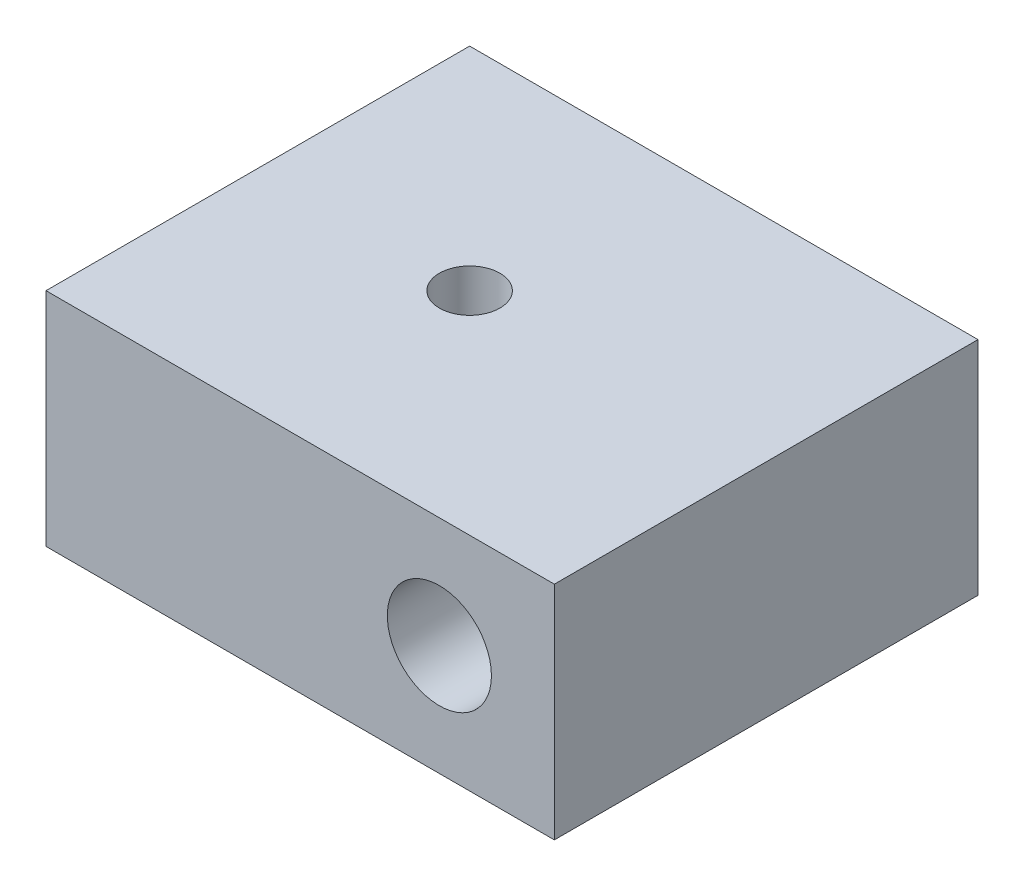
ISO-10303-21;
HEADER;
FILE_DESCRIPTION(('STEP AP214'),'2;1');
FILE_NAME('part.step','',(''),(''),'','','');
FILE_SCHEMA(('AUTOMOTIVE_DESIGN { 1 0 10303 214 1 1 1 1 }'));
ENDSEC;
DATA;
#1=APPLICATION_CONTEXT('core data for automotive mechanical design processes');
#2=APPLICATION_PROTOCOL_DEFINITION('international standard','automotive_design',2000,#1);
#3=PRODUCT_CONTEXT('',#1,'mechanical');
#4=PRODUCT('Part','Part','',(#3));
#5=PRODUCT_RELATED_PRODUCT_CATEGORY('part','',(#4));
#6=PRODUCT_DEFINITION_FORMATION('','',#4);
#7=PRODUCT_DEFINITION_CONTEXT('part definition',#1,'design');
#8=PRODUCT_DEFINITION('design','',#6,#7);
#9=PRODUCT_DEFINITION_SHAPE('','',#8);
#10=(LENGTH_UNIT() NAMED_UNIT(*) SI_UNIT(.MILLI.,.METRE.));
#11=(NAMED_UNIT(*) PLANE_ANGLE_UNIT() SI_UNIT($,.RADIAN.));
#12=(NAMED_UNIT(*) SI_UNIT($,.STERADIAN.) SOLID_ANGLE_UNIT());
#13=UNCERTAINTY_MEASURE_WITH_UNIT(LENGTH_MEASURE(1.E-05),#10,'distance_accuracy_value','');
#14=(GEOMETRIC_REPRESENTATION_CONTEXT(3) GLOBAL_UNCERTAINTY_ASSIGNED_CONTEXT((#13)) GLOBAL_UNIT_ASSIGNED_CONTEXT((#10,
#11,#12)) REPRESENTATION_CONTEXT('',''));
#15=CARTESIAN_POINT('',(0.,0.,0.));
#16=DIRECTION('',(0.,0.,1.));
#17=DIRECTION('',(1.,0.,0.));
#18=AXIS2_PLACEMENT_3D('',#15,#16,#17);
#19=CARTESIAN_POINT('',(0.,18.3,0.));
#20=DIRECTION('',(0.,-1.,0.));
#21=DIRECTION('',(0.,0.,-1.));
#22=AXIS2_PLACEMENT_3D('',#19,#20,#21);
#23=PLANE('',#22);
#24=DIRECTION('',(0.,0.,1.));
#25=VECTOR('',#24,1.);
#26=CARTESIAN_POINT('',(0.,18.3,0.));
#27=LINE('',#26,#25);
#28=CARTESIAN_POINT('',(0.,18.3,-35.));
#29=VERTEX_POINT('',#28);
#30=CARTESIAN_POINT('',(0.,18.3,0.));
#31=VERTEX_POINT('',#30);
#32=EDGE_CURVE('E84',#29,#31,#27,.T.);
#33=ORIENTED_EDGE('',*,*,#32,.T.);
#34=DIRECTION('',(1.,0.,0.));
#35=VECTOR('',#34,1.);
#36=CARTESIAN_POINT('',(0.,18.3,0.));
#37=LINE('',#36,#35);
#38=CARTESIAN_POINT('',(42.,18.3,0.));
#39=VERTEX_POINT('',#38);
#40=EDGE_CURVE('E79',#31,#39,#37,.T.);
#41=ORIENTED_EDGE('',*,*,#40,.T.);
#42=DIRECTION('',(0.,0.,-1.));
#43=VECTOR('',#42,1.);
#44=CARTESIAN_POINT('',(42.,18.3,0.));
#45=LINE('',#44,#43);
#46=CARTESIAN_POINT('',(42.,18.3,-35.));
#47=VERTEX_POINT('',#46);
#48=EDGE_CURVE('E82',#39,#47,#45,.T.);
#49=ORIENTED_EDGE('',*,*,#48,.T.);
#50=DIRECTION('',(-1.,0.,0.));
#51=VECTOR('',#50,1.);
#52=CARTESIAN_POINT('',(0.,18.3,-35.));
#53=LINE('',#52,#51);
#54=EDGE_CURVE('E49',#47,#29,#53,.T.);
#55=ORIENTED_EDGE('',*,*,#54,.T.);
#56=EDGE_LOOP('',(#33,#41,#49,#55));
#57=FACE_BOUND('',#56,.T.);
#58=CARTESIAN_POINT('',(17.5,18.3,-17.5));
#59=DIRECTION('',(0.,1.,0.));
#60=DIRECTION('',(0.,0.,1.));
#61=AXIS2_PLACEMENT_3D('',#58,#59,#60);
#62=CIRCLE('',#61,2.5);
#63=CARTESIAN_POINT('',(17.5,18.3,-15.));
#64=VERTEX_POINT('',#63);
#65=EDGE_CURVE('E99',#64,#64,#62,.T.);
#66=ORIENTED_EDGE('',*,*,#65,.F.);
#67=EDGE_LOOP('',(#66));
#68=FACE_BOUND('',#67,.T.);
#69=ADVANCED_FACE('F32',(#57,#68),#23,.F.);
#70=CARTESIAN_POINT('',(0.,0.,0.));
#71=DIRECTION('',(0.,-1.,0.));
#72=DIRECTION('',(0.,0.,-1.));
#73=AXIS2_PLACEMENT_3D('',#70,#71,#72);
#74=PLANE('',#73);
#75=DIRECTION('',(0.,0.,1.));
#76=VECTOR('',#75,1.);
#77=CARTESIAN_POINT('',(0.,0.,0.));
#78=LINE('',#77,#76);
#79=CARTESIAN_POINT('',(0.,0.,-35.));
#80=VERTEX_POINT('',#79);
#81=CARTESIAN_POINT('',(0.,0.,0.));
#82=VERTEX_POINT('',#81);
#83=EDGE_CURVE('E96',#80,#82,#78,.T.);
#84=ORIENTED_EDGE('',*,*,#83,.F.);
#85=DIRECTION('',(-1.,0.,0.));
#86=VECTOR('',#85,1.);
#87=CARTESIAN_POINT('',(0.,0.,-35.));
#88=LINE('',#87,#86);
#89=CARTESIAN_POINT('',(42.,0.,-35.));
#90=VERTEX_POINT('',#89);
#91=EDGE_CURVE('E72',#90,#80,#88,.T.);
#92=ORIENTED_EDGE('',*,*,#91,.F.);
#93=DIRECTION('',(0.,0.,-1.));
#94=VECTOR('',#93,1.);
#95=CARTESIAN_POINT('',(42.,0.,0.));
#96=LINE('',#95,#94);
#97=CARTESIAN_POINT('',(42.,0.,0.));
#98=VERTEX_POINT('',#97);
#99=EDGE_CURVE('E66',#98,#90,#96,.T.);
#100=ORIENTED_EDGE('',*,*,#99,.F.);
#101=DIRECTION('',(1.,0.,0.));
#102=VECTOR('',#101,1.);
#103=CARTESIAN_POINT('',(0.,0.,0.));
#104=LINE('',#103,#102);
#105=EDGE_CURVE('E88',#82,#98,#104,.T.);
#106=ORIENTED_EDGE('',*,*,#105,.F.);
#107=EDGE_LOOP('',(#84,#92,#100,#106));
#108=FACE_BOUND('',#107,.T.);
#109=CARTESIAN_POINT('',(17.5,0.,-17.5));
#110=DIRECTION('',(0.,1.,0.));
#111=DIRECTION('',(0.,0.,1.));
#112=AXIS2_PLACEMENT_3D('',#109,#110,#111);
#113=CIRCLE('',#112,2.5);
#114=CARTESIAN_POINT('',(17.5,0.,-15.));
#115=VERTEX_POINT('',#114);
#116=EDGE_CURVE('E111',#115,#115,#113,.T.);
#117=ORIENTED_EDGE('',*,*,#116,.T.);
#118=EDGE_LOOP('',(#117));
#119=FACE_BOUND('',#118,.T.);
#120=ADVANCED_FACE('F107',(#108,#119),#74,.T.);
#121=CARTESIAN_POINT('',(0.,18.3,0.));
#122=DIRECTION('',(1.,0.,0.));
#123=DIRECTION('',(0.,0.,-1.));
#124=AXIS2_PLACEMENT_3D('',#121,#122,#123);
#125=PLANE('',#124);
#126=ORIENTED_EDGE('',*,*,#83,.T.);
#127=DIRECTION('',(0.,-1.,0.));
#128=VECTOR('',#127,1.);
#129=CARTESIAN_POINT('',(0.,18.3,0.));
#130=LINE('',#129,#128);
#131=EDGE_CURVE('E11',#31,#82,#130,.T.);
#132=ORIENTED_EDGE('',*,*,#131,.F.);
#133=ORIENTED_EDGE('',*,*,#32,.F.);
#134=DIRECTION('',(0.,-1.,0.));
#135=VECTOR('',#134,1.);
#136=CARTESIAN_POINT('',(0.,18.3,-35.));
#137=LINE('',#136,#135);
#138=EDGE_CURVE('E92',#29,#80,#137,.T.);
#139=ORIENTED_EDGE('',*,*,#138,.T.);
#140=EDGE_LOOP('',(#126,#132,#133,#139));
#141=FACE_BOUND('',#140,.T.);
#142=ADVANCED_FACE('F34',(#141),#125,.F.);
#143=CARTESIAN_POINT('',(0.,18.3,0.));
#144=DIRECTION('',(0.,0.,-1.));
#145=DIRECTION('',(-1.,0.,0.));
#146=AXIS2_PLACEMENT_3D('',#143,#144,#145);
#147=PLANE('',#146);
#148=CARTESIAN_POINT('',(32.5,9.15,0.));
#149=DIRECTION('',(0.,0.,1.));
#150=DIRECTION('',(1.,0.,0.));
#151=AXIS2_PLACEMENT_3D('',#148,#149,#150);
#152=CIRCLE('',#151,4.3);
#153=CARTESIAN_POINT('',(36.8,9.15,0.));
#154=VERTEX_POINT('',#153);
#155=EDGE_CURVE('E117',#154,#154,#152,.T.);
#156=ORIENTED_EDGE('',*,*,#155,.F.);
#157=EDGE_LOOP('',(#156));
#158=FACE_BOUND('',#157,.T.);
#159=ORIENTED_EDGE('',*,*,#105,.T.);
#160=DIRECTION('',(0.,-1.,0.));
#161=VECTOR('',#160,1.);
#162=CARTESIAN_POINT('',(42.,18.3,0.));
#163=LINE('',#162,#161);
#164=EDGE_CURVE('E41',#39,#98,#163,.T.);
#165=ORIENTED_EDGE('',*,*,#164,.F.);
#166=ORIENTED_EDGE('',*,*,#40,.F.);
#167=ORIENTED_EDGE('',*,*,#131,.T.);
#168=EDGE_LOOP('',(#159,#165,#166,#167));
#169=FACE_BOUND('',#168,.T.);
#170=ADVANCED_FACE('F87',(#158,#169),#147,.F.);
#171=CARTESIAN_POINT('',(42.,18.3,0.));
#172=DIRECTION('',(-1.,0.,0.));
#173=DIRECTION('',(0.,0.,1.));
#174=AXIS2_PLACEMENT_3D('',#171,#172,#173);
#175=PLANE('',#174);
#176=ORIENTED_EDGE('',*,*,#99,.T.);
#177=DIRECTION('',(0.,-1.,0.));
#178=VECTOR('',#177,1.);
#179=CARTESIAN_POINT('',(42.,18.3,-35.));
#180=LINE('',#179,#178);
#181=EDGE_CURVE('E89',#47,#90,#180,.T.);
#182=ORIENTED_EDGE('',*,*,#181,.F.);
#183=ORIENTED_EDGE('',*,*,#48,.F.);
#184=ORIENTED_EDGE('',*,*,#164,.T.);
#185=EDGE_LOOP('',(#176,#182,#183,#184));
#186=FACE_BOUND('',#185,.T.);
#187=ADVANCED_FACE('F90',(#186),#175,.F.);
#188=CARTESIAN_POINT('',(0.,18.3,-35.));
#189=DIRECTION('',(0.,0.,1.));
#190=DIRECTION('',(1.,0.,0.));
#191=AXIS2_PLACEMENT_3D('',#188,#189,#190);
#192=PLANE('',#191);
#193=CARTESIAN_POINT('',(32.5,9.15,-35.));
#194=DIRECTION('',(0.,0.,1.));
#195=DIRECTION('',(1.,0.,0.));
#196=AXIS2_PLACEMENT_3D('',#193,#194,#195);
#197=CIRCLE('',#196,4.3);
#198=CARTESIAN_POINT('',(36.8,9.15,-35.));
#199=VERTEX_POINT('',#198);
#200=EDGE_CURVE('E114',#199,#199,#197,.T.);
#201=ORIENTED_EDGE('',*,*,#200,.T.);
#202=EDGE_LOOP('',(#201));
#203=FACE_BOUND('',#202,.T.);
#204=ORIENTED_EDGE('',*,*,#91,.T.);
#205=ORIENTED_EDGE('',*,*,#138,.F.);
#206=ORIENTED_EDGE('',*,*,#54,.F.);
#207=ORIENTED_EDGE('',*,*,#181,.T.);
#208=EDGE_LOOP('',(#204,#205,#206,#207));
#209=FACE_BOUND('',#208,.T.);
#210=ADVANCED_FACE('F104',(#203,#209),#192,.F.);
#211=CARTESIAN_POINT('',(17.5,18.3,-17.5));
#212=DIRECTION('',(0.,-1.,0.));
#213=DIRECTION('',(0.,0.,-1.));
#214=AXIS2_PLACEMENT_3D('',#211,#212,#213);
#215=CYLINDRICAL_SURFACE('',#214,2.5);
#216=ORIENTED_EDGE('',*,*,#65,.T.);
#217=EDGE_LOOP('',(#216));
#218=FACE_BOUND('',#217,.T.);
#219=ORIENTED_EDGE('',*,*,#116,.F.);
#220=EDGE_LOOP('',(#219));
#221=FACE_BOUND('',#220,.T.);
#222=ADVANCED_FACE('F127',(#218,#221),#215,.F.);
#223=CARTESIAN_POINT('',(32.5,9.15,-35.));
#224=DIRECTION('',(0.,0.,1.));
#225=DIRECTION('',(1.,0.,0.));
#226=AXIS2_PLACEMENT_3D('',#223,#224,#225);
#227=CYLINDRICAL_SURFACE('',#226,4.3);
#228=ORIENTED_EDGE('',*,*,#200,.F.);
#229=EDGE_LOOP('',(#228));
#230=FACE_BOUND('',#229,.T.);
#231=ORIENTED_EDGE('',*,*,#155,.T.);
#232=EDGE_LOOP('',(#231));
#233=FACE_BOUND('',#232,.T.);
#234=ADVANCED_FACE('F124',(#230,#233),#227,.F.);
#235=CLOSED_SHELL('',(#69,#120,#142,#170,#187,#210,#222,#234));
#236=MANIFOLD_SOLID_BREP('B2',#235);
#237=ADVANCED_BREP_SHAPE_REPRESENTATION('',(#18,#236),#14);
#238=SHAPE_DEFINITION_REPRESENTATION(#9,#237);
ENDSEC;
END-ISO-10303-21;
